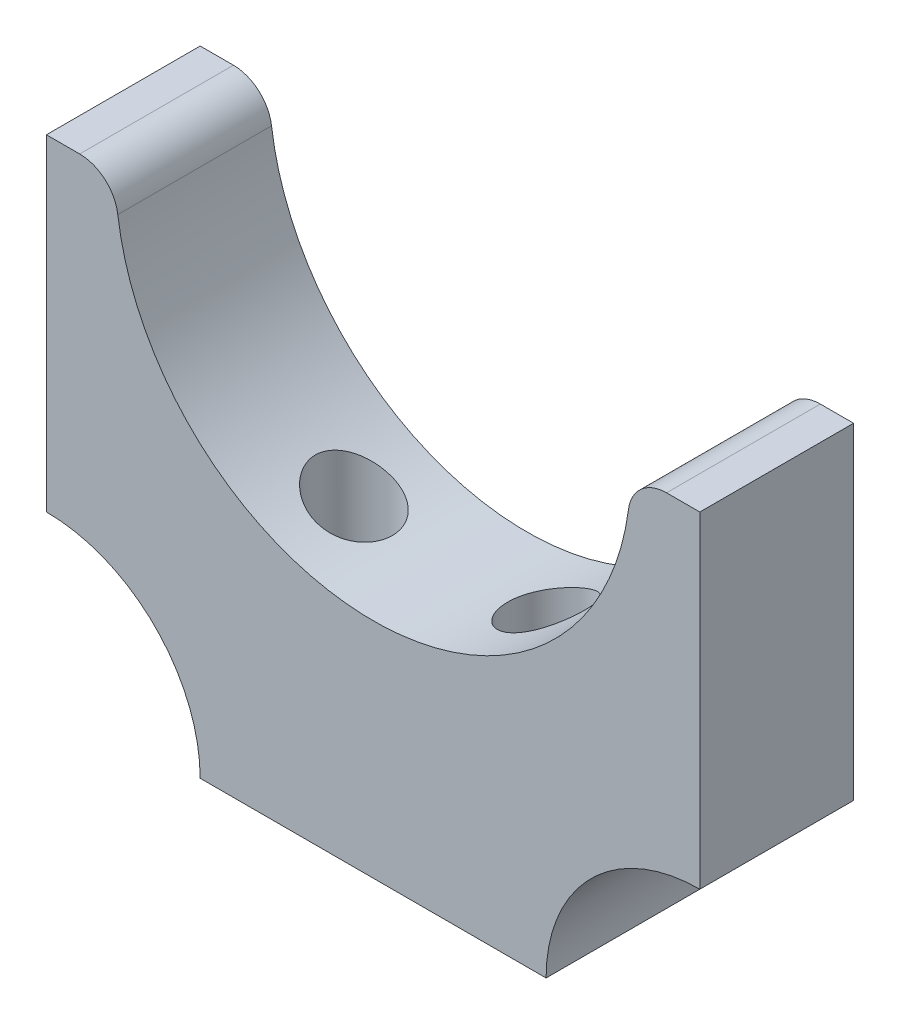
ISO-10303-21;
HEADER;
FILE_DESCRIPTION(('STEP AP214'),'2;1');
FILE_NAME('part.step','',(''),(''),'','','');
FILE_SCHEMA(('AUTOMOTIVE_DESIGN { 1 0 10303 214 1 1 1 1 }'));
ENDSEC;
DATA;
#1=APPLICATION_CONTEXT('core data for automotive mechanical design processes');
#2=APPLICATION_PROTOCOL_DEFINITION('international standard','automotive_design',2000,#1);
#3=PRODUCT_CONTEXT('',#1,'mechanical');
#4=PRODUCT('Part','Part','',(#3));
#5=PRODUCT_RELATED_PRODUCT_CATEGORY('part','',(#4));
#6=PRODUCT_DEFINITION_FORMATION('','',#4);
#7=PRODUCT_DEFINITION_CONTEXT('part definition',#1,'design');
#8=PRODUCT_DEFINITION('design','',#6,#7);
#9=PRODUCT_DEFINITION_SHAPE('','',#8);
#10=(LENGTH_UNIT() NAMED_UNIT(*) SI_UNIT(.MILLI.,.METRE.));
#11=(NAMED_UNIT(*) PLANE_ANGLE_UNIT() SI_UNIT($,.RADIAN.));
#12=(NAMED_UNIT(*) SI_UNIT($,.STERADIAN.) SOLID_ANGLE_UNIT());
#13=UNCERTAINTY_MEASURE_WITH_UNIT(LENGTH_MEASURE(1.E-05),#10,'distance_accuracy_value','');
#14=(GEOMETRIC_REPRESENTATION_CONTEXT(3) GLOBAL_UNCERTAINTY_ASSIGNED_CONTEXT((#13)) GLOBAL_UNIT_ASSIGNED_CONTEXT((#10,
#11,#12)) REPRESENTATION_CONTEXT('',''));
#15=CARTESIAN_POINT('',(0.,0.,0.));
#16=DIRECTION('',(0.,0.,1.));
#17=DIRECTION('',(1.,0.,0.));
#18=AXIS2_PLACEMENT_3D('',#15,#16,#17);
#19=CARTESIAN_POINT('',(13.4,12.5,8.));
#20=DIRECTION('',(0.,-1.,0.));
#21=DIRECTION('',(1.,0.,0.));
#22=AXIS2_PLACEMENT_3D('',#19,#20,#21);
#23=PLANE('',#22);
#24=DIRECTION('',(-1.,0.,0.));
#25=VECTOR('',#24,1.);
#26=CARTESIAN_POINT('',(13.4,12.5,0.));
#27=LINE('',#26,#25);
#28=CARTESIAN_POINT('',(17.,12.5,0.));
#29=VERTEX_POINT('',#28);
#30=CARTESIAN_POINT('',(15.2695775973011,12.5,0.));
#31=VERTEX_POINT('',#30);
#32=EDGE_CURVE('E151',#29,#31,#27,.T.);
#33=ORIENTED_EDGE('',*,*,#32,.T.);
#34=DIRECTION('',(0.,0.,-1.));
#35=VECTOR('',#34,1.);
#36=CARTESIAN_POINT('',(15.2695775973011,12.5,8.));
#37=LINE('',#36,#35);
#38=CARTESIAN_POINT('',(15.2695775973011,12.5,8.));
#39=VERTEX_POINT('',#38);
#40=EDGE_CURVE('E62',#31,#39,#37,.F.);
#41=ORIENTED_EDGE('',*,*,#40,.T.);
#42=DIRECTION('',(-1.,0.,0.));
#43=VECTOR('',#42,1.);
#44=CARTESIAN_POINT('',(13.4,12.5,8.));
#45=LINE('',#44,#43);
#46=CARTESIAN_POINT('',(17.,12.5,8.));
#47=VERTEX_POINT('',#46);
#48=EDGE_CURVE('E168',#47,#39,#45,.T.);
#49=ORIENTED_EDGE('',*,*,#48,.F.);
#50=DIRECTION('',(0.,0.,-1.));
#51=VECTOR('',#50,1.);
#52=CARTESIAN_POINT('',(17.,12.5,8.));
#53=LINE('',#52,#51);
#54=EDGE_CURVE('E150',#47,#29,#53,.T.);
#55=ORIENTED_EDGE('',*,*,#54,.T.);
#56=EDGE_LOOP('',(#33,#41,#49,#55));
#57=FACE_BOUND('',#56,.T.);
#58=ADVANCED_FACE('F39',(#57),#23,.F.);
#59=CARTESIAN_POINT('',(0.,12.5,8.));
#60=DIRECTION('',(0.,0.,-1.));
#61=DIRECTION('',(-1.,0.,0.));
#62=AXIS2_PLACEMENT_3D('',#59,#60,#61);
#63=CYLINDRICAL_SURFACE('',#62,13.4);
#64=CARTESIAN_POINT('',(-5.,0.0677837856639593,2.));
#65=CARTESIAN_POINT('',(-5.12287919141304,0.117206725010273,2.00000467371547));
#66=CARTESIAN_POINT('',(-5.24512278210269,0.168507461888875,2.01135281346105));
#67=CARTESIAN_POINT('',(-5.48480553881847,0.273222271834492,2.05581045016754));
#68=CARTESIAN_POINT('',(-5.60223563500203,0.326639992181113,2.08895918768068));
#69=CARTESIAN_POINT('',(-5.82897558705309,0.433570197685291,2.17585213218576));
#70=CARTESIAN_POINT('',(-5.93829567220504,0.487082473201271,2.22956984920757));
#71=CARTESIAN_POINT('',(-6.14611009340917,0.592066009692341,2.35645115186087));
#72=CARTESIAN_POINT('',(-6.24460583016682,0.643537534194853,2.42961221726241));
#73=CARTESIAN_POINT('',(-6.42785574674887,0.741875499587803,2.59415709271926));
#74=CARTESIAN_POINT('',(-6.51260665982274,0.788740844681787,2.68554522335087));
#75=CARTESIAN_POINT('',(-6.66496351995242,0.874771756177182,2.88483591797665));
#76=CARTESIAN_POINT('',(-6.73258130558985,0.913942635041491,2.9927269957083));
#77=CARTESIAN_POINT('',(-6.84130467124152,0.97784112667376,3.21074788215441));
#78=CARTESIAN_POINT('',(-6.88438333385516,1.00362035978185,3.31957849591715));
#79=CARTESIAN_POINT('',(-6.95108312176074,1.0438227490014,3.54499329930401));
#80=CARTESIAN_POINT('',(-6.9747320997333,1.05826215956574,3.66156613016986));
#81=CARTESIAN_POINT('',(-6.99905928785878,1.07313132589122,3.88098114609739));
#82=CARTESIAN_POINT('',(-7.00253638283833,1.07526776611989,3.98340584025517));
#83=CARTESIAN_POINT('',(-6.99381855328121,1.06992861406621,4.18731975998652));
#84=CARTESIAN_POINT('',(-6.98162763727915,1.06245548031583,4.28880921814301));
#85=CARTESIAN_POINT('',(-6.94338529696959,1.03920356274631,4.48210196537921));
#86=CARTESIAN_POINT('',(-6.91814935310931,1.02391396833626,4.57412929135589));
#87=CARTESIAN_POINT('',(-6.85548414879374,0.986370501426989,4.75240385764));
#88=CARTESIAN_POINT('',(-6.81805250054845,0.964115265162339,4.83864996205504));
#89=CARTESIAN_POINT('',(-6.7293895994123,0.912156164918828,5.0095104159796));
#90=CARTESIAN_POINT('',(-6.67737910158474,0.882041624936721,5.09359321907658));
#91=CARTESIAN_POINT('',(-6.56271022474464,0.816884695288644,5.25200290311142));
#92=CARTESIAN_POINT('',(-6.50004679911509,0.781839971407466,5.32632513045053));
#93=CARTESIAN_POINT('',(-6.35677156516543,0.703434428942727,5.47345171627979));
#94=CARTESIAN_POINT('',(-6.27488191093471,0.659586853000186,5.54475296318638));
#95=CARTESIAN_POINT('',(-6.10161255479528,0.569372262083474,5.67274203569453));
#96=CARTESIAN_POINT('',(-6.01022774282638,0.523003896949294,5.72942193470425));
#97=CARTESIAN_POINT('',(-5.80929094292169,0.424156101229431,5.83280947535458));
#98=CARTESIAN_POINT('',(-5.69884963739325,0.37157213838473,5.8776984763848));
#99=CARTESIAN_POINT('',(-5.47136558133141,0.267264261111955,5.94729777786655));
#100=CARTESIAN_POINT('',(-5.35432103856303,0.215540585161288,5.97200257152577));
#101=CARTESIAN_POINT('',(-5.11307514228363,0.113147523515931,6.00059767854649));
#102=CARTESIAN_POINT('',(-4.98876452535358,0.0625541792219903,6.0038528597687));
#103=CARTESIAN_POINT('',(-4.7400417933838,-0.0343448162694167,5.98694330107639));
#104=CARTESIAN_POINT('',(-4.61562971563036,-0.0806516420872253,5.96678499771553));
#105=CARTESIAN_POINT('',(-4.37686867997735,-0.165635396158886,5.90425840332894));
#106=CARTESIAN_POINT('',(-4.26232297635061,-0.204571246809864,5.86299793619195));
#107=CARTESIAN_POINT('',(-4.04119004813113,-0.27663106914337,5.7594227958816));
#108=CARTESIAN_POINT('',(-3.93459929684494,-0.309757625176585,5.69711752108286));
#109=CARTESIAN_POINT('',(-3.74057985809403,-0.367696933647637,5.55792166890844));
#110=CARTESIAN_POINT('',(-3.65233528189563,-0.39292662295083,5.48234032661238));
#111=CARTESIAN_POINT('',(-3.48964450494233,-0.43791007938481,5.31618079497706));
#112=CARTESIAN_POINT('',(-3.41519438810242,-0.457665401415859,5.22560687572163));
#113=CARTESIAN_POINT('',(-3.2860642751238,-0.490998166278076,5.03676707543271));
#114=CARTESIAN_POINT('',(-3.23061222921958,-0.504824806281293,4.93907213659596));
#115=CARTESIAN_POINT('',(-3.13670205506313,-0.527795285146501,4.73532163198474));
#116=CARTESIAN_POINT('',(-3.09824165329461,-0.53693975051895,4.62926718696818));
#117=CARTESIAN_POINT('',(-3.04026933611183,-0.550579927838031,4.41424042029453));
#118=CARTESIAN_POINT('',(-3.02037363304512,-0.555169927322401,4.30537735118654));
#119=CARTESIAN_POINT('',(-2.99879656016595,-0.56014340039986,4.08576718677618));
#120=CARTESIAN_POINT('',(-2.99711431048694,-0.560527077194544,3.97502018274295));
#121=CARTESIAN_POINT('',(-3.01197129335741,-0.557108540319931,3.75553082700501));
#122=CARTESIAN_POINT('',(-3.02839498713151,-0.553332868656762,3.64678021463757));
#123=CARTESIAN_POINT('',(-3.0787408218962,-0.541549622514173,3.433650108464));
#124=CARTESIAN_POINT('',(-3.11266264895909,-0.533542123956369,3.32927053627493));
#125=CARTESIAN_POINT('',(-3.19693534734025,-0.513127012475578,3.12770222337892));
#126=CARTESIAN_POINT('',(-3.24730381496827,-0.500714685573256,3.03052132178296));
#127=CARTESIAN_POINT('',(-3.36279223295021,-0.471320857740209,2.84614375512186));
#128=CARTESIAN_POINT('',(-3.42791165893454,-0.454339519225462,2.75894673531382));
#129=CARTESIAN_POINT('',(-3.57144734355516,-0.415507286634483,2.59602875462946));
#130=CARTESIAN_POINT('',(-3.64998403198189,-0.393611669282227,2.52042467158755));
#131=CARTESIAN_POINT('',(-3.81737100703674,-0.345048138838251,2.38349562916752));
#132=CARTESIAN_POINT('',(-3.90622443462904,-0.318378771017398,2.32217503561488));
#133=CARTESIAN_POINT('',(-4.09392444353442,-0.259690433324456,2.21363619202585));
#134=CARTESIAN_POINT('',(-4.19297434624869,-0.227547755865961,2.1668376828584));
#135=CARTESIAN_POINT('',(-4.39592767924155,-0.15888094230389,2.0903288285633));
#136=CARTESIAN_POINT('',(-4.49982699855005,-0.122360477597786,2.06060428400333));
#137=CARTESIAN_POINT('',(-4.67021138143867,-0.060016693946262,2.02624310033525));
#138=CARTESIAN_POINT('',(-4.73610777400501,-0.03532100419179,2.01637794832114));
#139=CARTESIAN_POINT('',(-4.86806367531069,0.0153311806145599,2.00325526472216));
#140=CARTESIAN_POINT('',(-4.93412317806949,0.0412876300727681,1.99999749437217));
#141=CARTESIAN_POINT('',(-5.,0.0677837856639593,2.));
#142=B_SPLINE_CURVE_WITH_KNOTS('',3,(#64,#65,#66,#67,#68,#69,#70,#71,#72,#73,#74,#75,#76,#77,
#78,#79,#80,#81,#82,#83,#84,#85,#86,#87,#88,#89,#90,#91,#92,#93,#94,#95,#96,#97,#98,#99,#100,
#101,#102,#103,#104,#105,#106,#107,#108,#109,#110,#111,#112,#113,#114,#115,#116,#117,#118,#119,
#120,#121,#122,#123,#124,#125,#126,#127,#128,#129,#130,#131,#132,#133,#134,#135,#136,#137,#138,
#139,#140,#141),.UNSPECIFIED.,.T.,.F.,(4,2,2,2,2,2,2,2,2,2,2,2,2,2,2,2,2,2,2,2,2,2,2,2,2,2,2,2,
2,2,2,2,2,2,2,2,2,2,4),(0.,0.397071435215653,0.794859552836666,1.19213708869798,
1.58936315488397,1.98668349239835,2.3837285377468,2.74112894931133,3.09801612483853,
3.40391988543909,3.70974539859959,3.9984233676734,4.2871578908407,4.59599228181329,
4.90497338684764,5.25485331225864,5.604922519432,5.99405656395217,6.38329673924194,
6.78401260720868,7.18461834125583,7.56607299712234,7.94735752436881,8.30223129814234,
8.65700417254205,8.99489886097274,9.33274832470941,9.66344775941407,9.99413121841885,
10.3227166508319,10.6512961884172,10.9802284324779,11.3091489854332,11.6411939265753,
11.9733402262525,12.3143451489686,12.6550660654102,12.8679479148355,13.0808220714001),.UNSPECIFIED.);
#143=CARTESIAN_POINT('',(-5.,0.0677837856639593,2.));
#144=VERTEX_POINT('',#143);
#145=EDGE_CURVE('E154',#144,#144,#142,.T.);
#146=ORIENTED_EDGE('',*,*,#145,.F.);
#147=EDGE_LOOP('',(#146));
#148=FACE_BOUND('',#147,.T.);
#149=CARTESIAN_POINT('',(5.,0.0677837856639593,2.));
#150=CARTESIAN_POINT('',(4.88631031558247,0.0220615588260659,2.00000312165205));
#151=CARTESIAN_POINT('',(4.77194111901483,-0.0221086898197741,2.00971232756499));
#152=CARTESIAN_POINT('',(4.54501413044202,-0.106248695634355,2.0490378867957));
#153=CARTESIAN_POINT('',(4.43245711785046,-0.146216684250922,2.07866258322129));
#154=CARTESIAN_POINT('',(4.21244425116883,-0.221197066615323,2.15786724262313));
#155=CARTESIAN_POINT('',(4.10500188050389,-0.256196796958267,2.20749700318859));
#156=CARTESIAN_POINT('',(3.89935911157634,-0.32055446496123,2.32588721807597));
#157=CARTESIAN_POINT('',(3.80115582356282,-0.349914169691787,2.39464166388166));
#158=CARTESIAN_POINT('',(3.6223333703175,-0.401431973367182,2.54568066303268));
#159=CARTESIAN_POINT('',(3.54108100306355,-0.423876480980692,2.6271181269192));
#160=CARTESIAN_POINT('',(3.3932630017884,-0.463473194954644,2.80349413999581));
#161=CARTESIAN_POINT('',(3.3266942802336,-0.480626514197311,2.89842984399008));
#162=CARTESIAN_POINT('',(3.21306265957759,-0.509209647847241,3.09489643609924));
#163=CARTESIAN_POINT('',(3.1653192452497,-0.520843042106775,3.19600478555328));
#164=CARTESIAN_POINT('',(3.08725761389349,-0.539572968369694,3.40513145971293));
#165=CARTESIAN_POINT('',(3.05693745029779,-0.546670007195549,3.51314901100684));
#166=CARTESIAN_POINT('',(3.015112470382,-0.556398964840519,3.73106555887614));
#167=CARTESIAN_POINT('',(3.00329953840334,-0.559104031261115,3.84090228200181));
#168=CARTESIAN_POINT('',(2.9979024403472,-0.560344179408541,4.06104474568297));
#169=CARTESIAN_POINT('',(3.00431755109362,-0.558879426568027,4.17135046745814));
#170=CARTESIAN_POINT('',(3.03509700037822,-0.551759629681107,4.38879516438731));
#171=CARTESIAN_POINT('',(3.05938297164841,-0.546122880040779,4.49594584805847));
#172=CARTESIAN_POINT('',(3.12501723686162,-0.530556242902323,4.70455331112382));
#173=CARTESIAN_POINT('',(3.16636522383217,-0.520626432642948,4.80601019292113));
#174=CARTESIAN_POINT('',(3.26488970852957,-0.49627115230337,5.00066042400013));
#175=CARTESIAN_POINT('',(3.3221064203045,-0.481834248645236,5.09383197395494));
#176=CARTESIAN_POINT('',(3.45042905925465,-0.448317374435393,5.26910534416382));
#177=CARTESIAN_POINT('',(3.52153519306022,-0.429237334807573,5.35120699970241));
#178=CARTESIAN_POINT('',(3.6762754785444,-0.386097683683237,5.50321706663511));
#179=CARTESIAN_POINT('',(3.76005432264648,-0.361979142738317,5.57296128988274));
#180=CARTESIAN_POINT('',(3.93676138763771,-0.30899722998981,5.69741210302421));
#181=CARTESIAN_POINT('',(4.02969059305704,-0.280133347388484,5.75211707236788));
#182=CARTESIAN_POINT('',(4.22487325369171,-0.216968149895089,5.8469750008219));
#183=CARTESIAN_POINT('',(4.32732734448233,-0.182525098551252,5.88661976662053));
#184=CARTESIAN_POINT('',(4.53591871552098,-0.109427560040303,5.94845395955902));
#185=CARTESIAN_POINT('',(4.64205687949534,-0.0707720575761483,5.97063916790561));
#186=CARTESIAN_POINT('',(4.8611462559925,0.0122571555359022,5.99839453717546));
#187=CARTESIAN_POINT('',(4.97414768226027,0.0568294365644683,6.00297048498003));
#188=CARTESIAN_POINT('',(5.19819715474984,0.148747792767278,5.99331494850529));
#189=CARTESIAN_POINT('',(5.30924453723449,0.196094787661154,5.97907719406584));
#190=CARTESIAN_POINT('',(5.53411911247468,0.295508147889175,5.93101142751901));
#191=CARTESIAN_POINT('',(5.64763463242495,0.347678247078224,5.89593561710481));
#192=CARTESIAN_POINT('',(5.86678046761367,0.45194479468309,5.8062997770185));
#193=CARTESIAN_POINT('',(5.97240746545569,0.504041203174782,5.75173160529994));
#194=CARTESIAN_POINT('',(6.17666767416753,0.607886693437991,5.62191533481922));
#195=CARTESIAN_POINT('',(6.27492092772547,0.65955819199655,5.54600353799015));
#196=CARTESIAN_POINT('',(6.45701720577807,0.75786876397723,5.37572780468218));
#197=CARTESIAN_POINT('',(6.54086111590761,0.804508146620362,5.28136500301157));
#198=CARTESIAN_POINT('',(6.68661712941778,0.887256435794916,5.08156347676754));
#199=CARTESIAN_POINT('',(6.7494656263195,0.923796521305292,4.97699235689405));
#200=CARTESIAN_POINT('',(6.85581726179574,0.986459489215961,4.75561707912019));
#201=CARTESIAN_POINT('',(6.89934917116731,1.01259785826167,4.63883143675214));
#202=CARTESIAN_POINT('',(6.95965444046034,1.04904900307506,4.41396903132423));
#203=CARTESIAN_POINT('',(6.97930590170805,1.061056366783,4.30693773287123));
#204=CARTESIAN_POINT('',(7.00090375343007,1.07426043026637,4.09046777978342));
#205=CARTESIAN_POINT('',(7.00286349271256,1.07546528077996,3.98103100264939));
#206=CARTESIAN_POINT('',(6.98973924949873,1.06743353451022,3.77554198759328));
#207=CARTESIAN_POINT('',(6.97647446095278,1.05931137562239,3.67932151148936));
#208=CARTESIAN_POINT('',(6.93648942232809,1.0350247830976,3.49079075618516));
#209=CARTESIAN_POINT('',(6.90976834196441,1.01885985320345,3.39848071864923));
#210=CARTESIAN_POINT('',(6.84348891181714,0.979229032238312,3.21838406895902));
#211=CARTESIAN_POINT('',(6.80371338722076,0.955639925385217,3.13070534700272));
#212=CARTESIAN_POINT('',(6.71297766459063,0.9026431329107,2.96328204751374));
#213=CARTESIAN_POINT('',(6.66201376852323,0.873233523786547,2.88354010597855));
#214=CARTESIAN_POINT('',(6.54401781951081,0.806372379772779,2.72449915776906));
#215=CARTESIAN_POINT('',(6.47581417902094,0.768385631629727,2.64629601902219));
#216=CARTESIAN_POINT('',(6.3293178509565,0.688704741395101,2.50217205718641));
#217=CARTESIAN_POINT('',(6.25101798315529,0.647007967415484,2.43626005770073));
#218=CARTESIAN_POINT('',(6.07526273250165,0.555871451023438,2.30972779360592));
#219=CARTESIAN_POINT('',(5.97664200261858,0.506133682805149,2.25093713040221));
#220=CARTESIAN_POINT('',(5.77118288035972,0.405931359434581,2.15113177200013));
#221=CARTESIAN_POINT('',(5.66434752788406,0.355467078700701,2.11011053797802));
#222=CARTESIAN_POINT('',(5.46509611608144,0.264705857600159,2.05259901200582));
#223=CARTESIAN_POINT('',(5.37364404416225,0.224246685683085,2.03298379626905));
#224=CARTESIAN_POINT('',(5.18828399343416,0.144763157021007,2.00668327826144));
#225=CARTESIAN_POINT('',(5.09437612256858,0.105738737393033,1.99999740865306));
#226=CARTESIAN_POINT('',(5.,0.0677837856639593,2.));
#227=B_SPLINE_CURVE_WITH_KNOTS('',3,(#149,#150,#151,#152,#153,#154,#155,#156,#157,#158,#159,
#160,#161,#162,#163,#164,#165,#166,#167,#168,#169,#170,#171,#172,#173,#174,#175,#176,#177,#178,
#179,#180,#181,#182,#183,#184,#185,#186,#187,#188,#189,#190,#191,#192,#193,#194,#195,#196,#197,
#198,#199,#200,#201,#202,#203,#204,#205,#206,#207,#208,#209,#210,#211,#212,#213,#214,#215,#216,
#217,#218,#219,#220,#221,#222,#223,#224,#225,#226),.UNSPECIFIED.,.T.,.F.,(4,2,2,2,2,2,2,2,2,2,2,
2,2,2,2,2,2,2,2,2,2,2,2,2,2,2,2,2,2,2,2,2,2,2,2,2,2,2,4),(0.,0.367281522962492,
0.734717005500233,1.10307283122561,1.47131305886787,1.82116477676788,2.17094286099146,
2.5065619019872,2.84214343952465,3.17207635683843,3.50199618463572,3.83047780594217,
4.15895351760576,4.48826937070522,4.81759012334877,5.15100296822362,5.48445172582736,
5.82832113135988,6.1722736013631,6.53538288301944,6.89861321090286,7.28616280499636,
7.67387446994767,8.07531138835645,8.47672362460068,8.85656650237391,9.2358417142245,
9.56240432242833,9.88872051107508,10.1797684308104,10.4708343110894,10.7670111101622,
11.0632859507788,11.3934797473953,11.7239096796817,12.097703041701,12.4713587375354,
12.7762599895395,13.0811478622244),.UNSPECIFIED.);
#228=CARTESIAN_POINT('',(5.,0.0677837856639593,2.));
#229=VERTEX_POINT('',#228);
#230=EDGE_CURVE('E273',#229,#229,#227,.T.);
#231=ORIENTED_EDGE('',*,*,#230,.F.);
#232=EDGE_LOOP('',(#231));
#233=FACE_BOUND('',#232,.T.);
#234=CARTESIAN_POINT('',(0.,12.5,8.));
#235=DIRECTION('',(0.,0.,-1.));
#236=DIRECTION('',(1.,0.,0.));
#237=AXIS2_PLACEMENT_3D('',#234,#235,#236);
#238=CIRCLE('',#237,13.4);
#239=CARTESIAN_POINT('',(13.2865155716776,10.7597402597403,8.));
#240=VERTEX_POINT('',#239);
#241=CARTESIAN_POINT('',(-13.2865155716776,10.7597402597403,8.));
#242=VERTEX_POINT('',#241);
#243=EDGE_CURVE('E124',#240,#242,#238,.T.);
#244=ORIENTED_EDGE('',*,*,#243,.F.);
#245=DIRECTION('',(0.,0.,-1.));
#246=VECTOR('',#245,1.);
#247=CARTESIAN_POINT('',(13.2865155716776,10.7597402597403,8.));
#248=LINE('',#247,#246);
#249=CARTESIAN_POINT('',(13.2865155716776,10.7597402597403,0.));
#250=VERTEX_POINT('',#249);
#251=EDGE_CURVE('E194',#240,#250,#248,.T.);
#252=ORIENTED_EDGE('',*,*,#251,.T.);
#253=CARTESIAN_POINT('',(0.,12.5,0.));
#254=DIRECTION('',(0.,0.,-1.));
#255=DIRECTION('',(1.,0.,0.));
#256=AXIS2_PLACEMENT_3D('',#253,#254,#255);
#257=CIRCLE('',#256,13.4);
#258=CARTESIAN_POINT('',(-13.2865155716776,10.7597402597403,0.));
#259=VERTEX_POINT('',#258);
#260=EDGE_CURVE('E153',#250,#259,#257,.T.);
#261=ORIENTED_EDGE('',*,*,#260,.T.);
#262=DIRECTION('',(0.,0.,-1.));
#263=VECTOR('',#262,1.);
#264=CARTESIAN_POINT('',(-13.2865155716776,10.7597402597403,8.));
#265=LINE('',#264,#263);
#266=EDGE_CURVE('E192',#259,#242,#265,.F.);
#267=ORIENTED_EDGE('',*,*,#266,.T.);
#268=EDGE_LOOP('',(#244,#252,#261,#267));
#269=FACE_BOUND('',#268,.T.);
#270=ADVANCED_FACE('F207',(#148,#233,#269),#63,.F.);
#271=CARTESIAN_POINT('',(-13.4,12.5,8.));
#272=DIRECTION('',(0.,-1.,0.));
#273=DIRECTION('',(1.,0.,0.));
#274=AXIS2_PLACEMENT_3D('',#271,#272,#273);
#275=PLANE('',#274);
#276=DIRECTION('',(-1.,0.,0.));
#277=VECTOR('',#276,1.);
#278=CARTESIAN_POINT('',(-13.4,12.5,8.));
#279=LINE('',#278,#277);
#280=CARTESIAN_POINT('',(-15.2695775973011,12.5,8.));
#281=VERTEX_POINT('',#280);
#282=CARTESIAN_POINT('',(-17.,12.5,8.));
#283=VERTEX_POINT('',#282);
#284=EDGE_CURVE('E116',#281,#283,#279,.T.);
#285=ORIENTED_EDGE('',*,*,#284,.F.);
#286=DIRECTION('',(0.,0.,-1.));
#287=VECTOR('',#286,1.);
#288=CARTESIAN_POINT('',(-15.2695775973011,12.5,8.));
#289=LINE('',#288,#287);
#290=CARTESIAN_POINT('',(-15.2695775973011,12.5,0.));
#291=VERTEX_POINT('',#290);
#292=EDGE_CURVE('E11',#281,#291,#289,.T.);
#293=ORIENTED_EDGE('',*,*,#292,.T.);
#294=DIRECTION('',(-1.,0.,0.));
#295=VECTOR('',#294,1.);
#296=CARTESIAN_POINT('',(-13.4,12.5,0.));
#297=LINE('',#296,#295);
#298=CARTESIAN_POINT('',(-17.,12.5,0.));
#299=VERTEX_POINT('',#298);
#300=EDGE_CURVE('E130',#291,#299,#297,.T.);
#301=ORIENTED_EDGE('',*,*,#300,.T.);
#302=DIRECTION('',(0.,0.,-1.));
#303=VECTOR('',#302,1.);
#304=CARTESIAN_POINT('',(-17.,12.5,8.));
#305=LINE('',#304,#303);
#306=EDGE_CURVE('E127',#283,#299,#305,.T.);
#307=ORIENTED_EDGE('',*,*,#306,.F.);
#308=EDGE_LOOP('',(#285,#293,#301,#307));
#309=FACE_BOUND('',#308,.T.);
#310=ADVANCED_FACE('F128',(#309),#275,.F.);
#311=CARTESIAN_POINT('',(-17.,12.5,8.));
#312=DIRECTION('',(1.,0.,0.));
#313=DIRECTION('',(0.,0.,-1.));
#314=AXIS2_PLACEMENT_3D('',#311,#312,#313);
#315=PLANE('',#314);
#316=DIRECTION('',(0.,-1.,0.));
#317=VECTOR('',#316,1.);
#318=CARTESIAN_POINT('',(-17.,12.5,0.));
#319=LINE('',#318,#317);
#320=CARTESIAN_POINT('',(-17.,-4.5,0.));
#321=VERTEX_POINT('',#320);
#322=EDGE_CURVE('E158',#299,#321,#319,.T.);
#323=ORIENTED_EDGE('',*,*,#322,.T.);
#324=DIRECTION('',(0.,0.,-1.));
#325=VECTOR('',#324,1.);
#326=CARTESIAN_POINT('',(-17.,-4.5,8.));
#327=LINE('',#326,#325);
#328=CARTESIAN_POINT('',(-17.,-4.5,8.));
#329=VERTEX_POINT('',#328);
#330=EDGE_CURVE('E134',#329,#321,#327,.T.);
#331=ORIENTED_EDGE('',*,*,#330,.F.);
#332=DIRECTION('',(0.,-1.,0.));
#333=VECTOR('',#332,1.);
#334=CARTESIAN_POINT('',(-17.,12.5,8.));
#335=LINE('',#334,#333);
#336=EDGE_CURVE('E120',#283,#329,#335,.T.);
#337=ORIENTED_EDGE('',*,*,#336,.F.);
#338=ORIENTED_EDGE('',*,*,#306,.T.);
#339=EDGE_LOOP('',(#323,#331,#337,#338));
#340=FACE_BOUND('',#339,.T.);
#341=ADVANCED_FACE('F136',(#340),#315,.F.);
#342=CARTESIAN_POINT('',(-17.,-12.5,8.));
#343=DIRECTION('',(0.,0.,-1.));
#344=DIRECTION('',(-1.,0.,0.));
#345=AXIS2_PLACEMENT_3D('',#342,#343,#344);
#346=CYLINDRICAL_SURFACE('',#345,8.);
#347=CARTESIAN_POINT('',(-17.,-12.5,0.));
#348=DIRECTION('',(0.,0.,-1.));
#349=DIRECTION('',(-1.,0.,0.));
#350=AXIS2_PLACEMENT_3D('',#347,#348,#349);
#351=CIRCLE('',#350,8.);
#352=CARTESIAN_POINT('',(-9.00000000000001,-12.5,0.));
#353=VERTEX_POINT('',#352);
#354=EDGE_CURVE('E160',#321,#353,#351,.T.);
#355=ORIENTED_EDGE('',*,*,#354,.T.);
#356=DIRECTION('',(0.,0.,-1.));
#357=VECTOR('',#356,1.);
#358=CARTESIAN_POINT('',(-9.00000000000001,-12.5,8.));
#359=LINE('',#358,#357);
#360=CARTESIAN_POINT('',(-9.00000000000001,-12.5,8.));
#361=VERTEX_POINT('',#360);
#362=EDGE_CURVE('E177',#361,#353,#359,.T.);
#363=ORIENTED_EDGE('',*,*,#362,.F.);
#364=CARTESIAN_POINT('',(-17.,-12.5,8.));
#365=DIRECTION('',(0.,0.,-1.));
#366=DIRECTION('',(-1.,0.,0.));
#367=AXIS2_PLACEMENT_3D('',#364,#365,#366);
#368=CIRCLE('',#367,8.);
#369=EDGE_CURVE('E139',#329,#361,#368,.T.);
#370=ORIENTED_EDGE('',*,*,#369,.F.);
#371=ORIENTED_EDGE('',*,*,#330,.T.);
#372=EDGE_LOOP('',(#355,#363,#370,#371));
#373=FACE_BOUND('',#372,.T.);
#374=ADVANCED_FACE('F232',(#373),#346,.F.);
#375=CARTESIAN_POINT('',(-9.00000000000001,-12.5,8.));
#376=DIRECTION('',(0.,1.,0.));
#377=DIRECTION('',(0.,0.,1.));
#378=AXIS2_PLACEMENT_3D('',#375,#376,#377);
#379=PLANE('',#378);
#380=CARTESIAN_POINT('',(5.,-12.5,4.));
#381=DIRECTION('',(0.,1.,0.));
#382=DIRECTION('',(0.,0.,1.));
#383=AXIS2_PLACEMENT_3D('',#380,#381,#382);
#384=CIRCLE('',#383,3.);
#385=CARTESIAN_POINT('',(5.,-12.5,7.));
#386=VERTEX_POINT('',#385);
#387=EDGE_CURVE('E186',#386,#386,#384,.T.);
#388=ORIENTED_EDGE('',*,*,#387,.T.);
#389=EDGE_LOOP('',(#388));
#390=FACE_BOUND('',#389,.T.);
#391=CARTESIAN_POINT('',(-5.,-12.5,4.));
#392=DIRECTION('',(0.,1.,0.));
#393=DIRECTION('',(0.,0.,1.));
#394=AXIS2_PLACEMENT_3D('',#391,#392,#393);
#395=CIRCLE('',#394,3.);
#396=CARTESIAN_POINT('',(-5.,-12.5,7.));
#397=VERTEX_POINT('',#396);
#398=EDGE_CURVE('E183',#397,#397,#395,.T.);
#399=ORIENTED_EDGE('',*,*,#398,.T.);
#400=EDGE_LOOP('',(#399));
#401=FACE_BOUND('',#400,.T.);
#402=DIRECTION('',(1.,0.,0.));
#403=VECTOR('',#402,1.);
#404=CARTESIAN_POINT('',(-9.00000000000001,-12.5,0.));
#405=LINE('',#404,#403);
#406=CARTESIAN_POINT('',(9.00000000000001,-12.5,0.));
#407=VERTEX_POINT('',#406);
#408=EDGE_CURVE('E162',#353,#407,#405,.T.);
#409=ORIENTED_EDGE('',*,*,#408,.T.);
#410=DIRECTION('',(0.,0.,-1.));
#411=VECTOR('',#410,1.);
#412=CARTESIAN_POINT('',(9.00000000000001,-12.5,8.));
#413=LINE('',#412,#411);
#414=CARTESIAN_POINT('',(9.00000000000001,-12.5,8.));
#415=VERTEX_POINT('',#414);
#416=EDGE_CURVE('E174',#415,#407,#413,.T.);
#417=ORIENTED_EDGE('',*,*,#416,.F.);
#418=DIRECTION('',(1.,0.,0.));
#419=VECTOR('',#418,1.);
#420=CARTESIAN_POINT('',(-9.00000000000001,-12.5,8.));
#421=LINE('',#420,#419);
#422=EDGE_CURVE('E141',#361,#415,#421,.T.);
#423=ORIENTED_EDGE('',*,*,#422,.F.);
#424=ORIENTED_EDGE('',*,*,#362,.T.);
#425=EDGE_LOOP('',(#409,#417,#423,#424));
#426=FACE_BOUND('',#425,.T.);
#427=ADVANCED_FACE('F229',(#390,#401,#426),#379,.F.);
#428=CARTESIAN_POINT('',(17.,-12.5,8.));
#429=DIRECTION('',(0.,0.,-1.));
#430=DIRECTION('',(-1.,0.,0.));
#431=AXIS2_PLACEMENT_3D('',#428,#429,#430);
#432=CYLINDRICAL_SURFACE('',#431,8.);
#433=CARTESIAN_POINT('',(17.,-12.5,0.));
#434=DIRECTION('',(0.,0.,-1.));
#435=DIRECTION('',(1.,0.,0.));
#436=AXIS2_PLACEMENT_3D('',#433,#434,#435);
#437=CIRCLE('',#436,8.);
#438=CARTESIAN_POINT('',(17.,-4.5,0.));
#439=VERTEX_POINT('',#438);
#440=EDGE_CURVE('E164',#407,#439,#437,.T.);
#441=ORIENTED_EDGE('',*,*,#440,.T.);
#442=DIRECTION('',(0.,0.,-1.));
#443=VECTOR('',#442,1.);
#444=CARTESIAN_POINT('',(17.,-4.5,8.));
#445=LINE('',#444,#443);
#446=CARTESIAN_POINT('',(17.,-4.5,8.));
#447=VERTEX_POINT('',#446);
#448=EDGE_CURVE('E171',#447,#439,#445,.T.);
#449=ORIENTED_EDGE('',*,*,#448,.F.);
#450=CARTESIAN_POINT('',(17.,-12.5,8.));
#451=DIRECTION('',(0.,0.,-1.));
#452=DIRECTION('',(1.,0.,0.));
#453=AXIS2_PLACEMENT_3D('',#450,#451,#452);
#454=CIRCLE('',#453,8.);
#455=EDGE_CURVE('E146',#415,#447,#454,.T.);
#456=ORIENTED_EDGE('',*,*,#455,.F.);
#457=ORIENTED_EDGE('',*,*,#416,.T.);
#458=EDGE_LOOP('',(#441,#449,#456,#457));
#459=FACE_BOUND('',#458,.T.);
#460=ADVANCED_FACE('F224',(#459),#432,.F.);
#461=CARTESIAN_POINT('',(17.,-4.5,8.));
#462=DIRECTION('',(-1.,0.,0.));
#463=DIRECTION('',(0.,-1.,0.));
#464=AXIS2_PLACEMENT_3D('',#461,#462,#463);
#465=PLANE('',#464);
#466=DIRECTION('',(0.,1.,0.));
#467=VECTOR('',#466,1.);
#468=CARTESIAN_POINT('',(17.,-4.5,0.));
#469=LINE('',#468,#467);
#470=EDGE_CURVE('E166',#439,#29,#469,.T.);
#471=ORIENTED_EDGE('',*,*,#470,.T.);
#472=ORIENTED_EDGE('',*,*,#54,.F.);
#473=DIRECTION('',(0.,1.,0.));
#474=VECTOR('',#473,1.);
#475=CARTESIAN_POINT('',(17.,-4.5,8.));
#476=LINE('',#475,#474);
#477=EDGE_CURVE('E148',#447,#47,#476,.T.);
#478=ORIENTED_EDGE('',*,*,#477,.F.);
#479=ORIENTED_EDGE('',*,*,#448,.T.);
#480=EDGE_LOOP('',(#471,#472,#478,#479));
#481=FACE_BOUND('',#480,.T.);
#482=ADVANCED_FACE('F218',(#481),#465,.F.);
#483=CARTESIAN_POINT('',(17.,-12.5,8.));
#484=DIRECTION('',(0.,0.,1.));
#485=DIRECTION('',(1.,0.,0.));
#486=AXIS2_PLACEMENT_3D('',#483,#484,#485);
#487=PLANE('',#486);
#488=ORIENTED_EDGE('',*,*,#48,.T.);
#489=CARTESIAN_POINT('',(15.2695775973011,10.5,8.));
#490=DIRECTION('',(0.,0.,1.));
#491=DIRECTION('',(1.,0.,0.));
#492=AXIS2_PLACEMENT_3D('',#489,#490,#491);
#493=CIRCLE('',#492,2.);
#494=EDGE_CURVE('E47',#39,#240,#493,.T.);
#495=ORIENTED_EDGE('',*,*,#494,.T.);
#496=ORIENTED_EDGE('',*,*,#243,.T.);
#497=CARTESIAN_POINT('',(-15.2695775973011,10.5,8.));
#498=DIRECTION('',(0.,0.,1.));
#499=DIRECTION('',(1.,0.,0.));
#500=AXIS2_PLACEMENT_3D('',#497,#498,#499);
#501=CIRCLE('',#500,2.);
#502=EDGE_CURVE('E54',#242,#281,#501,.T.);
#503=ORIENTED_EDGE('',*,*,#502,.T.);
#504=ORIENTED_EDGE('',*,*,#284,.T.);
#505=ORIENTED_EDGE('',*,*,#336,.T.);
#506=ORIENTED_EDGE('',*,*,#369,.T.);
#507=ORIENTED_EDGE('',*,*,#422,.T.);
#508=ORIENTED_EDGE('',*,*,#455,.T.);
#509=ORIENTED_EDGE('',*,*,#477,.T.);
#510=EDGE_LOOP('',(#488,#495,#496,#503,#504,#505,#506,#507,#508,#509));
#511=FACE_BOUND('',#510,.T.);
#512=ADVANCED_FACE('F118',(#511),#487,.T.);
#513=CARTESIAN_POINT('',(17.,-12.5,0.));
#514=DIRECTION('',(0.,0.,1.));
#515=DIRECTION('',(1.,0.,0.));
#516=AXIS2_PLACEMENT_3D('',#513,#514,#515);
#517=PLANE('',#516);
#518=ORIENTED_EDGE('',*,*,#260,.F.);
#519=CARTESIAN_POINT('',(15.2695775973011,10.5,0.));
#520=DIRECTION('',(0.,0.,1.));
#521=DIRECTION('',(1.,0.,0.));
#522=AXIS2_PLACEMENT_3D('',#519,#520,#521);
#523=CIRCLE('',#522,2.);
#524=EDGE_CURVE('E199',#250,#31,#523,.F.);
#525=ORIENTED_EDGE('',*,*,#524,.T.);
#526=ORIENTED_EDGE('',*,*,#32,.F.);
#527=ORIENTED_EDGE('',*,*,#470,.F.);
#528=ORIENTED_EDGE('',*,*,#440,.F.);
#529=ORIENTED_EDGE('',*,*,#408,.F.);
#530=ORIENTED_EDGE('',*,*,#354,.F.);
#531=ORIENTED_EDGE('',*,*,#322,.F.);
#532=ORIENTED_EDGE('',*,*,#300,.F.);
#533=CARTESIAN_POINT('',(-15.2695775973011,10.5,0.));
#534=DIRECTION('',(0.,0.,1.));
#535=DIRECTION('',(1.,0.,0.));
#536=AXIS2_PLACEMENT_3D('',#533,#534,#535);
#537=CIRCLE('',#536,2.);
#538=EDGE_CURVE('E197',#291,#259,#537,.F.);
#539=ORIENTED_EDGE('',*,*,#538,.T.);
#540=EDGE_LOOP('',(#518,#525,#526,#527,#528,#529,#530,#531,#532,#539));
#541=FACE_BOUND('',#540,.T.);
#542=ADVANCED_FACE('F213',(#541),#517,.F.);
#543=CARTESIAN_POINT('',(5.,12.501,4.));
#544=DIRECTION('',(0.,-1.,0.));
#545=DIRECTION('',(0.,0.,-1.));
#546=AXIS2_PLACEMENT_3D('',#543,#544,#545);
#547=CYLINDRICAL_SURFACE('',#546,2.);
#548=CARTESIAN_POINT('',(5.,-11.5,4.));
#549=DIRECTION('',(0.,1.,0.));
#550=DIRECTION('',(0.,0.,1.));
#551=AXIS2_PLACEMENT_3D('',#548,#549,#550);
#552=CIRCLE('',#551,2.);
#553=CARTESIAN_POINT('',(5.,-11.5,6.));
#554=VERTEX_POINT('',#553);
#555=EDGE_CURVE('E133',#554,#554,#552,.F.);
#556=ORIENTED_EDGE('',*,*,#555,.T.);
#557=EDGE_LOOP('',(#556));
#558=FACE_BOUND('',#557,.T.);
#559=ORIENTED_EDGE('',*,*,#230,.T.);
#560=EDGE_LOOP('',(#559));
#561=FACE_BOUND('',#560,.T.);
#562=ADVANCED_FACE('F269',(#558,#561),#547,.F.);
#563=CARTESIAN_POINT('',(-5.,12.501,4.));
#564=DIRECTION('',(0.,-1.,0.));
#565=DIRECTION('',(0.,0.,-1.));
#566=AXIS2_PLACEMENT_3D('',#563,#564,#565);
#567=CYLINDRICAL_SURFACE('',#566,2.);
#568=CARTESIAN_POINT('',(-5.,-11.5,4.));
#569=DIRECTION('',(0.,1.,0.));
#570=DIRECTION('',(0.,0.,1.));
#571=AXIS2_PLACEMENT_3D('',#568,#569,#570);
#572=CIRCLE('',#571,2.);
#573=CARTESIAN_POINT('',(-5.,-11.5,6.));
#574=VERTEX_POINT('',#573);
#575=EDGE_CURVE('E189',#574,#574,#572,.F.);
#576=ORIENTED_EDGE('',*,*,#575,.T.);
#577=EDGE_LOOP('',(#576));
#578=FACE_BOUND('',#577,.T.);
#579=ORIENTED_EDGE('',*,*,#145,.T.);
#580=EDGE_LOOP('',(#579));
#581=FACE_BOUND('',#580,.T.);
#582=ADVANCED_FACE('F255',(#578,#581),#567,.F.);
#583=CARTESIAN_POINT('',(5.,-11.5,4.));
#584=DIRECTION('',(0.,-1.,0.));
#585=DIRECTION('',(0.,0.,-1.));
#586=AXIS2_PLACEMENT_3D('',#583,#584,#585);
#587=CONICAL_SURFACE('',#586,2.,0.785398163397449);
#588=ORIENTED_EDGE('',*,*,#387,.F.);
#589=EDGE_LOOP('',(#588));
#590=FACE_BOUND('',#589,.T.);
#591=ORIENTED_EDGE('',*,*,#555,.F.);
#592=EDGE_LOOP('',(#591));
#593=FACE_BOUND('',#592,.T.);
#594=ADVANCED_FACE('F249',(#590,#593),#587,.F.);
#595=CARTESIAN_POINT('',(-5.,-11.5,4.));
#596=DIRECTION('',(0.,-1.,0.));
#597=DIRECTION('',(0.,0.,-1.));
#598=AXIS2_PLACEMENT_3D('',#595,#596,#597);
#599=CONICAL_SURFACE('',#598,2.,0.785398163397449);
#600=ORIENTED_EDGE('',*,*,#398,.F.);
#601=EDGE_LOOP('',(#600));
#602=FACE_BOUND('',#601,.T.);
#603=ORIENTED_EDGE('',*,*,#575,.F.);
#604=EDGE_LOOP('',(#603));
#605=FACE_BOUND('',#604,.T.);
#606=ADVANCED_FACE('F238',(#602,#605),#599,.F.);
#607=CARTESIAN_POINT('',(15.2695775973011,10.5,8.));
#608=DIRECTION('',(0.,0.,-1.));
#609=DIRECTION('',(-1.,0.,0.));
#610=AXIS2_PLACEMENT_3D('',#607,#608,#609);
#611=CYLINDRICAL_SURFACE('',#610,2.);
#612=ORIENTED_EDGE('',*,*,#494,.F.);
#613=ORIENTED_EDGE('',*,*,#40,.F.);
#614=ORIENTED_EDGE('',*,*,#524,.F.);
#615=ORIENTED_EDGE('',*,*,#251,.F.);
#616=EDGE_LOOP('',(#612,#613,#614,#615));
#617=FACE_BOUND('',#616,.T.);
#618=ADVANCED_FACE('F210',(#617),#611,.T.);
#619=CARTESIAN_POINT('',(-15.2695775973011,10.5,8.));
#620=DIRECTION('',(0.,0.,-1.));
#621=DIRECTION('',(-1.,0.,0.));
#622=AXIS2_PLACEMENT_3D('',#619,#620,#621);
#623=CYLINDRICAL_SURFACE('',#622,2.);
#624=ORIENTED_EDGE('',*,*,#502,.F.);
#625=ORIENTED_EDGE('',*,*,#266,.F.);
#626=ORIENTED_EDGE('',*,*,#538,.F.);
#627=ORIENTED_EDGE('',*,*,#292,.F.);
#628=EDGE_LOOP('',(#624,#625,#626,#627));
#629=FACE_BOUND('',#628,.T.);
#630=ADVANCED_FACE('F41',(#629),#623,.T.);
#631=CLOSED_SHELL('',(#58,#270,#310,#341,#374,#427,#460,#482,#512,#542,#562,#582,#594,#606,#618,#630));
#632=MANIFOLD_SOLID_BREP('B2',#631);
#633=ADVANCED_BREP_SHAPE_REPRESENTATION('',(#18,#632),#14);
#634=SHAPE_DEFINITION_REPRESENTATION(#9,#633);
ENDSEC;
END-ISO-10303-21;
